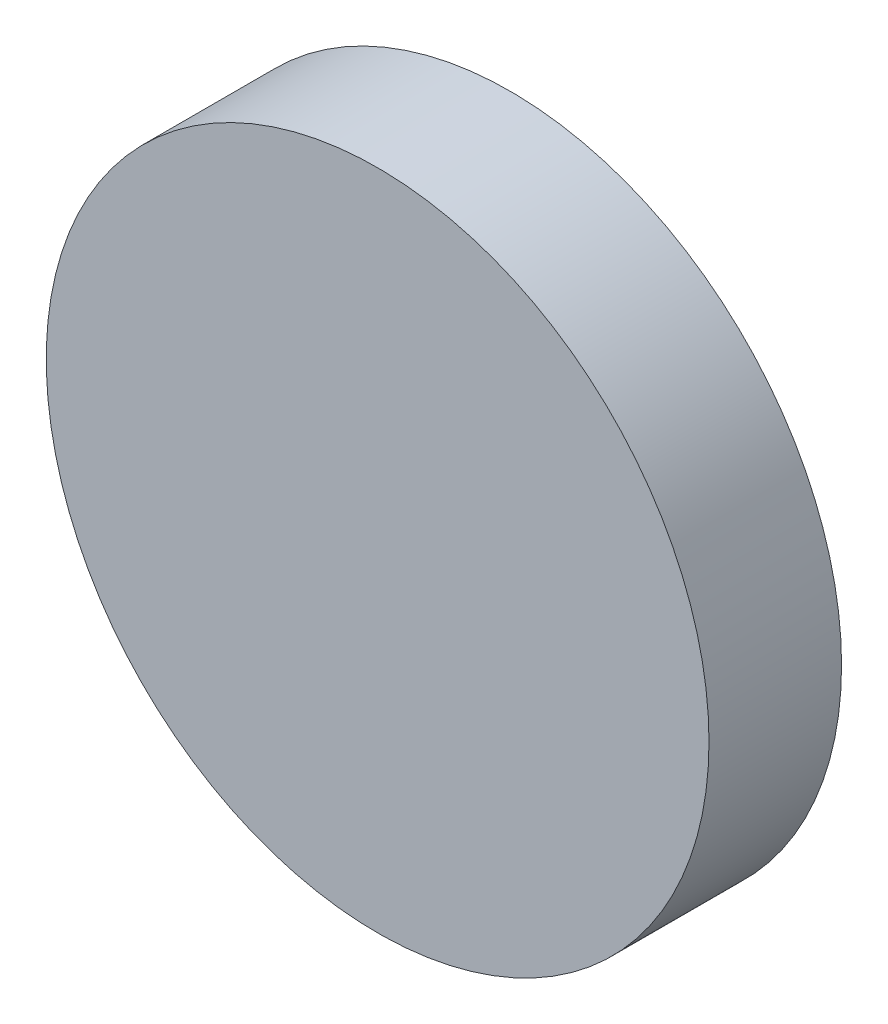
ISO-10303-21;
HEADER;
FILE_DESCRIPTION(('STEP AP214'),'2;1');
FILE_NAME('part.step','',(''),(''),'','','');
FILE_SCHEMA(('AUTOMOTIVE_DESIGN { 1 0 10303 214 1 1 1 1 }'));
ENDSEC;
DATA;
#1=APPLICATION_CONTEXT('core data for automotive mechanical design processes');
#2=APPLICATION_PROTOCOL_DEFINITION('international standard','automotive_design',2000,#1);
#3=PRODUCT_CONTEXT('',#1,'mechanical');
#4=PRODUCT('Part','Part','',(#3));
#5=PRODUCT_RELATED_PRODUCT_CATEGORY('part','',(#4));
#6=PRODUCT_DEFINITION_FORMATION('','',#4);
#7=PRODUCT_DEFINITION_CONTEXT('part definition',#1,'design');
#8=PRODUCT_DEFINITION('design','',#6,#7);
#9=PRODUCT_DEFINITION_SHAPE('','',#8);
#10=(LENGTH_UNIT() NAMED_UNIT(*) SI_UNIT(.MILLI.,.METRE.));
#11=(NAMED_UNIT(*) PLANE_ANGLE_UNIT() SI_UNIT($,.RADIAN.));
#12=(NAMED_UNIT(*) SI_UNIT($,.STERADIAN.) SOLID_ANGLE_UNIT());
#13=UNCERTAINTY_MEASURE_WITH_UNIT(LENGTH_MEASURE(1.E-05),#10,'distance_accuracy_value','');
#14=(GEOMETRIC_REPRESENTATION_CONTEXT(3) GLOBAL_UNCERTAINTY_ASSIGNED_CONTEXT((#13)) GLOBAL_UNIT_ASSIGNED_CONTEXT((#10,
#11,#12)) REPRESENTATION_CONTEXT('',''));
#15=CARTESIAN_POINT('',(0.,0.,0.));
#16=DIRECTION('',(0.,0.,1.));
#17=DIRECTION('',(1.,0.,0.));
#18=AXIS2_PLACEMENT_3D('',#15,#16,#17);
#19=CARTESIAN_POINT('',(0.,0.,2.));
#20=DIRECTION('',(0.,0.,-1.));
#21=DIRECTION('',(-1.,0.,0.));
#22=AXIS2_PLACEMENT_3D('',#19,#20,#21);
#23=CYLINDRICAL_SURFACE('',#22,5.);
#24=CARTESIAN_POINT('',(0.,0.,2.));
#25=DIRECTION('',(0.,0.,1.));
#26=DIRECTION('',(1.,0.,0.));
#27=AXIS2_PLACEMENT_3D('',#24,#25,#26);
#28=CIRCLE('',#27,5.);
#29=CARTESIAN_POINT('',(5.,0.,2.));
#30=VERTEX_POINT('',#29);
#31=EDGE_CURVE('E10',#30,#30,#28,.T.);
#32=ORIENTED_EDGE('',*,*,#31,.F.);
#33=EDGE_LOOP('',(#32));
#34=FACE_BOUND('',#33,.T.);
#35=CARTESIAN_POINT('',(0.,0.,0.));
#36=DIRECTION('',(0.,0.,1.));
#37=DIRECTION('',(1.,0.,0.));
#38=AXIS2_PLACEMENT_3D('',#35,#36,#37);
#39=CIRCLE('',#38,5.);
#40=CARTESIAN_POINT('',(5.,0.,0.));
#41=VERTEX_POINT('',#40);
#42=EDGE_CURVE('E40',#41,#41,#39,.T.);
#43=ORIENTED_EDGE('',*,*,#42,.T.);
#44=EDGE_LOOP('',(#43));
#45=FACE_BOUND('',#44,.T.);
#46=ADVANCED_FACE('F37',(#34,#45),#23,.T.);
#47=CARTESIAN_POINT('',(0.,0.,2.));
#48=DIRECTION('',(0.,0.,1.));
#49=DIRECTION('',(1.,0.,0.));
#50=AXIS2_PLACEMENT_3D('',#47,#48,#49);
#51=PLANE('',#50);
#52=ORIENTED_EDGE('',*,*,#31,.T.);
#53=EDGE_LOOP('',(#52));
#54=FACE_BOUND('',#53,.T.);
#55=ADVANCED_FACE('F54',(#54),#51,.T.);
#56=CARTESIAN_POINT('',(0.,0.,0.));
#57=DIRECTION('',(0.,0.,1.));
#58=DIRECTION('',(1.,0.,0.));
#59=AXIS2_PLACEMENT_3D('',#56,#57,#58);
#60=PLANE('',#59);
#61=ORIENTED_EDGE('',*,*,#42,.F.);
#62=EDGE_LOOP('',(#61));
#63=FACE_BOUND('',#62,.T.);
#64=ADVANCED_FACE('F52',(#63),#60,.F.);
#65=CLOSED_SHELL('',(#46,#55,#64));
#66=MANIFOLD_SOLID_BREP('B2',#65);
#67=ADVANCED_BREP_SHAPE_REPRESENTATION('',(#18,#66),#14);
#68=SHAPE_DEFINITION_REPRESENTATION(#9,#67);
ENDSEC;
END-ISO-10303-21;
